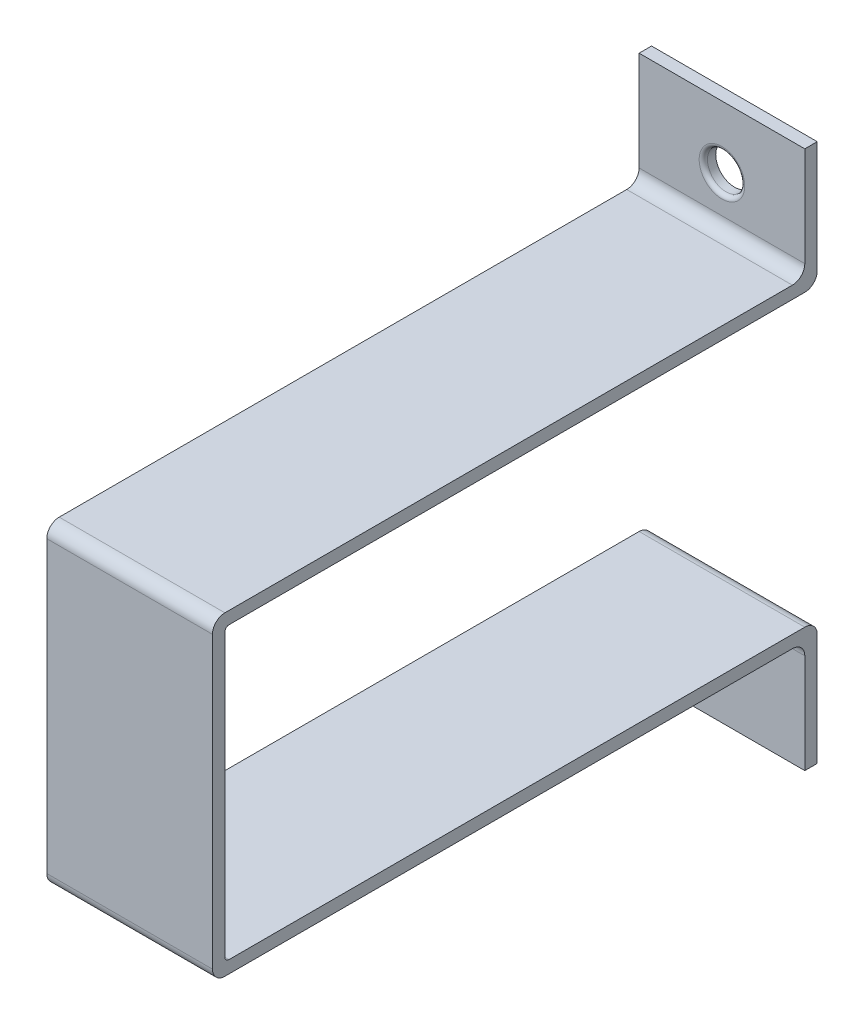
ISO-10303-21;
HEADER;
FILE_DESCRIPTION(('STEP AP214'),'2;1');
FILE_NAME('part.step','',(''),(''),'','','');
FILE_SCHEMA(('AUTOMOTIVE_DESIGN { 1 0 10303 214 1 1 1 1 }'));
ENDSEC;
DATA;
#1=APPLICATION_CONTEXT('core data for automotive mechanical design processes');
#2=APPLICATION_PROTOCOL_DEFINITION('international standard','automotive_design',2000,#1);
#3=PRODUCT_CONTEXT('',#1,'mechanical');
#4=PRODUCT('Part','Part','',(#3));
#5=PRODUCT_RELATED_PRODUCT_CATEGORY('part','',(#4));
#6=PRODUCT_DEFINITION_FORMATION('','',#4);
#7=PRODUCT_DEFINITION_CONTEXT('part definition',#1,'design');
#8=PRODUCT_DEFINITION('design','',#6,#7);
#9=PRODUCT_DEFINITION_SHAPE('','',#8);
#10=(LENGTH_UNIT() NAMED_UNIT(*) SI_UNIT(.MILLI.,.METRE.));
#11=(NAMED_UNIT(*) PLANE_ANGLE_UNIT() SI_UNIT($,.RADIAN.));
#12=(NAMED_UNIT(*) SI_UNIT($,.STERADIAN.) SOLID_ANGLE_UNIT());
#13=UNCERTAINTY_MEASURE_WITH_UNIT(LENGTH_MEASURE(1.E-05),#10,'distance_accuracy_value','');
#14=(GEOMETRIC_REPRESENTATION_CONTEXT(3) GLOBAL_UNCERTAINTY_ASSIGNED_CONTEXT((#13)) GLOBAL_UNIT_ASSIGNED_CONTEXT((#10,
#11,#12)) REPRESENTATION_CONTEXT('',''));
#15=CARTESIAN_POINT('',(0.,0.,0.));
#16=DIRECTION('',(0.,0.,1.));
#17=DIRECTION('',(1.,0.,0.));
#18=AXIS2_PLACEMENT_3D('',#15,#16,#17);
#19=CARTESIAN_POINT('',(-20.,35.,3.));
#20=DIRECTION('',(1.,0.,0.));
#21=DIRECTION('',(0.,0.,-1.));
#22=AXIS2_PLACEMENT_3D('',#19,#20,#21);
#23=PLANE('',#22);
#24=DIRECTION('',(0.,0.,1.));
#25=VECTOR('',#24,1.);
#26=CARTESIAN_POINT('',(-20.,-35.,-180.112342240263));
#27=LINE('',#26,#25);
#28=CARTESIAN_POINT('',(-20.,-35.,-140.));
#29=VERTEX_POINT('',#28);
#30=CARTESIAN_POINT('',(-20.,-35.,-1.00000000000006));
#31=VERTEX_POINT('',#30);
#32=EDGE_CURVE('E219',#29,#31,#27,.T.);
#33=ORIENTED_EDGE('',*,*,#32,.F.);
#34=CARTESIAN_POINT('',(-20.,-38.,-140.));
#35=DIRECTION('',(1.,0.,0.));
#36=DIRECTION('',(0.,0.,-1.));
#37=AXIS2_PLACEMENT_3D('',#34,#35,#36);
#38=CIRCLE('',#37,3.);
#39=CARTESIAN_POINT('',(-20.,-38.,-143.));
#40=VERTEX_POINT('',#39);
#41=EDGE_CURVE('E314',#29,#40,#38,.F.);
#42=ORIENTED_EDGE('',*,*,#41,.T.);
#43=DIRECTION('',(0.,1.,0.));
#44=VECTOR('',#43,1.);
#45=CARTESIAN_POINT('',(-20.,-35.,-143.));
#46=LINE('',#45,#44);
#47=CARTESIAN_POINT('',(-20.,-65.,-143.));
#48=VERTEX_POINT('',#47);
#49=EDGE_CURVE('E188',#48,#40,#46,.T.);
#50=ORIENTED_EDGE('',*,*,#49,.F.);
#51=DIRECTION('',(0.,0.,1.));
#52=VECTOR('',#51,1.);
#53=CARTESIAN_POINT('',(-20.,-65.,-143.));
#54=LINE('',#53,#52);
#55=CARTESIAN_POINT('',(-20.,-65.,-140.));
#56=VERTEX_POINT('',#55);
#57=EDGE_CURVE('E186',#48,#56,#54,.T.);
#58=ORIENTED_EDGE('',*,*,#57,.T.);
#59=DIRECTION('',(0.,1.,0.));
#60=VECTOR('',#59,1.);
#61=CARTESIAN_POINT('',(-20.,-35.,-140.));
#62=LINE('',#61,#60);
#63=CARTESIAN_POINT('',(-20.,-41.,-140.));
#64=VERTEX_POINT('',#63);
#65=EDGE_CURVE('E179',#56,#64,#62,.T.);
#66=ORIENTED_EDGE('',*,*,#65,.T.);
#67=CARTESIAN_POINT('',(-20.,-41.,-137.));
#68=DIRECTION('',(1.,0.,0.));
#69=DIRECTION('',(0.,0.,-1.));
#70=AXIS2_PLACEMENT_3D('',#67,#68,#69);
#71=CIRCLE('',#70,3.);
#72=CARTESIAN_POINT('',(-20.,-38.,-137.));
#73=VERTEX_POINT('',#72);
#74=EDGE_CURVE('E298',#64,#73,#71,.T.);
#75=ORIENTED_EDGE('',*,*,#74,.T.);
#76=DIRECTION('',(0.,0.,1.));
#77=VECTOR('',#76,1.);
#78=CARTESIAN_POINT('',(-20.,-38.,-180.112342240263));
#79=LINE('',#78,#77);
#80=CARTESIAN_POINT('',(-20.,-38.,0.));
#81=VERTEX_POINT('',#80);
#82=EDGE_CURVE('E218',#73,#81,#79,.T.);
#83=ORIENTED_EDGE('',*,*,#82,.T.);
#84=CARTESIAN_POINT('',(-20.,-35.,0.));
#85=DIRECTION('',(1.,0.,0.));
#86=DIRECTION('',(0.,0.,-1.));
#87=AXIS2_PLACEMENT_3D('',#84,#85,#86);
#88=CIRCLE('',#87,3.);
#89=CARTESIAN_POINT('',(-20.,-35.,3.));
#90=VERTEX_POINT('',#89);
#91=EDGE_CURVE('E272',#81,#90,#88,.F.);
#92=ORIENTED_EDGE('',*,*,#91,.T.);
#93=DIRECTION('',(0.,-1.,0.));
#94=VECTOR('',#93,1.);
#95=CARTESIAN_POINT('',(-20.,35.,3.));
#96=LINE('',#95,#94);
#97=CARTESIAN_POINT('',(-20.,35.,3.));
#98=VERTEX_POINT('',#97);
#99=EDGE_CURVE('E235',#98,#90,#96,.T.);
#100=ORIENTED_EDGE('',*,*,#99,.F.);
#101=CARTESIAN_POINT('',(-20.,35.,0.));
#102=DIRECTION('',(1.,0.,0.));
#103=DIRECTION('',(0.,0.,-1.));
#104=AXIS2_PLACEMENT_3D('',#101,#102,#103);
#105=CIRCLE('',#104,3.);
#106=CARTESIAN_POINT('',(-20.,38.,0.));
#107=VERTEX_POINT('',#106);
#108=EDGE_CURVE('E274',#98,#107,#105,.F.);
#109=ORIENTED_EDGE('',*,*,#108,.T.);
#110=DIRECTION('',(0.,0.,1.));
#111=VECTOR('',#110,1.);
#112=CARTESIAN_POINT('',(-20.,38.,-180.112342240263));
#113=LINE('',#112,#111);
#114=CARTESIAN_POINT('',(-20.,38.,-137.));
#115=VERTEX_POINT('',#114);
#116=EDGE_CURVE('E227',#115,#107,#113,.T.);
#117=ORIENTED_EDGE('',*,*,#116,.F.);
#118=CARTESIAN_POINT('',(-20.,41.,-137.));
#119=DIRECTION('',(1.,0.,0.));
#120=DIRECTION('',(0.,0.,-1.));
#121=AXIS2_PLACEMENT_3D('',#118,#119,#120);
#122=CIRCLE('',#121,3.);
#123=CARTESIAN_POINT('',(-20.,41.,-140.));
#124=VERTEX_POINT('',#123);
#125=EDGE_CURVE('E304',#115,#124,#122,.T.);
#126=ORIENTED_EDGE('',*,*,#125,.T.);
#127=DIRECTION('',(0.,1.,0.));
#128=VECTOR('',#127,1.);
#129=CARTESIAN_POINT('',(-20.,35.,-140.));
#130=LINE('',#129,#128);
#131=CARTESIAN_POINT('',(-20.,65.,-140.));
#132=VERTEX_POINT('',#131);
#133=EDGE_CURVE('E197',#124,#132,#130,.T.);
#134=ORIENTED_EDGE('',*,*,#133,.T.);
#135=DIRECTION('',(0.,0.,1.));
#136=VECTOR('',#135,1.);
#137=CARTESIAN_POINT('',(-20.,65.,-143.));
#138=LINE('',#137,#136);
#139=CARTESIAN_POINT('',(-20.,65.,-143.));
#140=VERTEX_POINT('',#139);
#141=EDGE_CURVE('E215',#140,#132,#138,.T.);
#142=ORIENTED_EDGE('',*,*,#141,.F.);
#143=DIRECTION('',(0.,1.,0.));
#144=VECTOR('',#143,1.);
#145=CARTESIAN_POINT('',(-20.,35.,-143.));
#146=LINE('',#145,#144);
#147=CARTESIAN_POINT('',(-20.,38.,-143.));
#148=VERTEX_POINT('',#147);
#149=EDGE_CURVE('E205',#148,#140,#146,.T.);
#150=ORIENTED_EDGE('',*,*,#149,.F.);
#151=CARTESIAN_POINT('',(-20.,38.,-140.));
#152=DIRECTION('',(1.,0.,0.));
#153=DIRECTION('',(0.,0.,-1.));
#154=AXIS2_PLACEMENT_3D('',#151,#152,#153);
#155=CIRCLE('',#154,3.);
#156=CARTESIAN_POINT('',(-20.,35.,-140.));
#157=VERTEX_POINT('',#156);
#158=EDGE_CURVE('E47',#148,#157,#155,.F.);
#159=ORIENTED_EDGE('',*,*,#158,.T.);
#160=DIRECTION('',(0.,0.,1.));
#161=VECTOR('',#160,1.);
#162=CARTESIAN_POINT('',(-20.,35.,-180.112342240263));
#163=LINE('',#162,#161);
#164=CARTESIAN_POINT('',(-20.,35.,-1.00000000000006));
#165=VERTEX_POINT('',#164);
#166=EDGE_CURVE('E221',#157,#165,#163,.T.);
#167=ORIENTED_EDGE('',*,*,#166,.T.);
#168=CARTESIAN_POINT('',(-20.,34.,-1.));
#169=DIRECTION('',(1.,0.,0.));
#170=DIRECTION('',(0.,0.,-1.));
#171=AXIS2_PLACEMENT_3D('',#168,#169,#170);
#172=CIRCLE('',#171,1.);
#173=CARTESIAN_POINT('',(-20.,34.,0.));
#174=VERTEX_POINT('',#173);
#175=EDGE_CURVE('E261',#165,#174,#172,.T.);
#176=ORIENTED_EDGE('',*,*,#175,.T.);
#177=DIRECTION('',(0.,-1.,0.));
#178=VECTOR('',#177,1.);
#179=CARTESIAN_POINT('',(-20.,35.,0.));
#180=LINE('',#179,#178);
#181=CARTESIAN_POINT('',(-20.,-34.,0.));
#182=VERTEX_POINT('',#181);
#183=EDGE_CURVE('E229',#174,#182,#180,.T.);
#184=ORIENTED_EDGE('',*,*,#183,.T.);
#185=CARTESIAN_POINT('',(-20.,-34.,-1.));
#186=DIRECTION('',(1.,0.,0.));
#187=DIRECTION('',(0.,0.,-1.));
#188=AXIS2_PLACEMENT_3D('',#185,#186,#187);
#189=CIRCLE('',#188,1.);
#190=EDGE_CURVE('E258',#182,#31,#189,.T.);
#191=ORIENTED_EDGE('',*,*,#190,.T.);
#192=EDGE_LOOP('',(#33,#42,#50,#58,#66,#75,#83,#92,#100,#109,#117,#126,#134,#142,#150,#159,#167,
#176,#184,#191));
#193=FACE_BOUND('',#192,.T.);
#194=ADVANCED_FACE('F32',(#193),#23,.F.);
#195=CARTESIAN_POINT('',(20.,35.,3.));
#196=DIRECTION('',(-1.,0.,0.));
#197=DIRECTION('',(0.,0.,1.));
#198=AXIS2_PLACEMENT_3D('',#195,#196,#197);
#199=PLANE('',#198);
#200=DIRECTION('',(0.,-1.,0.));
#201=VECTOR('',#200,1.);
#202=CARTESIAN_POINT('',(20.,-35.,-143.));
#203=LINE('',#202,#201);
#204=CARTESIAN_POINT('',(20.,-38.,-143.));
#205=VERTEX_POINT('',#204);
#206=CARTESIAN_POINT('',(20.,-65.,-143.));
#207=VERTEX_POINT('',#206);
#208=EDGE_CURVE('E169',#205,#207,#203,.T.);
#209=ORIENTED_EDGE('',*,*,#208,.F.);
#210=CARTESIAN_POINT('',(20.,-38.,-140.));
#211=DIRECTION('',(-1.,0.,0.));
#212=DIRECTION('',(0.,0.,1.));
#213=AXIS2_PLACEMENT_3D('',#210,#211,#212);
#214=CIRCLE('',#213,3.);
#215=CARTESIAN_POINT('',(20.,-35.,-140.));
#216=VERTEX_POINT('',#215);
#217=EDGE_CURVE('E309',#205,#216,#214,.F.);
#218=ORIENTED_EDGE('',*,*,#217,.T.);
#219=DIRECTION('',(0.,0.,1.));
#220=VECTOR('',#219,1.);
#221=CARTESIAN_POINT('',(20.,-35.,-180.112342240263));
#222=LINE('',#221,#220);
#223=CARTESIAN_POINT('',(20.,-35.,-1.00000000000006));
#224=VERTEX_POINT('',#223);
#225=EDGE_CURVE('E222',#216,#224,#222,.T.);
#226=ORIENTED_EDGE('',*,*,#225,.T.);
#227=CARTESIAN_POINT('',(20.,-34.,-1.));
#228=DIRECTION('',(-1.,0.,0.));
#229=DIRECTION('',(0.,0.,1.));
#230=AXIS2_PLACEMENT_3D('',#227,#228,#229);
#231=CIRCLE('',#230,1.);
#232=CARTESIAN_POINT('',(20.,-34.,0.));
#233=VERTEX_POINT('',#232);
#234=EDGE_CURVE('E256',#224,#233,#231,.T.);
#235=ORIENTED_EDGE('',*,*,#234,.T.);
#236=DIRECTION('',(0.,1.,0.));
#237=VECTOR('',#236,1.);
#238=CARTESIAN_POINT('',(20.,35.,0.));
#239=LINE('',#238,#237);
#240=CARTESIAN_POINT('',(20.,34.,0.));
#241=VERTEX_POINT('',#240);
#242=EDGE_CURVE('E239',#233,#241,#239,.T.);
#243=ORIENTED_EDGE('',*,*,#242,.T.);
#244=CARTESIAN_POINT('',(20.,34.,-1.));
#245=DIRECTION('',(-1.,0.,0.));
#246=DIRECTION('',(0.,0.,1.));
#247=AXIS2_PLACEMENT_3D('',#244,#245,#246);
#248=CIRCLE('',#247,1.);
#249=CARTESIAN_POINT('',(20.,35.,-1.00000000000006));
#250=VERTEX_POINT('',#249);
#251=EDGE_CURVE('E263',#241,#250,#248,.T.);
#252=ORIENTED_EDGE('',*,*,#251,.T.);
#253=DIRECTION('',(0.,0.,1.));
#254=VECTOR('',#253,1.);
#255=CARTESIAN_POINT('',(20.,35.,-180.112342240263));
#256=LINE('',#255,#254);
#257=CARTESIAN_POINT('',(20.,35.,-140.));
#258=VERTEX_POINT('',#257);
#259=EDGE_CURVE('E232',#258,#250,#256,.T.);
#260=ORIENTED_EDGE('',*,*,#259,.F.);
#261=CARTESIAN_POINT('',(20.,38.,-140.));
#262=DIRECTION('',(-1.,0.,0.));
#263=DIRECTION('',(0.,0.,1.));
#264=AXIS2_PLACEMENT_3D('',#261,#262,#263);
#265=CIRCLE('',#264,3.);
#266=CARTESIAN_POINT('',(20.,38.,-143.));
#267=VERTEX_POINT('',#266);
#268=EDGE_CURVE('E307',#258,#267,#265,.F.);
#269=ORIENTED_EDGE('',*,*,#268,.T.);
#270=DIRECTION('',(0.,-1.,0.));
#271=VECTOR('',#270,1.);
#272=CARTESIAN_POINT('',(20.,35.,-143.));
#273=LINE('',#272,#271);
#274=CARTESIAN_POINT('',(20.,65.,-143.));
#275=VERTEX_POINT('',#274);
#276=EDGE_CURVE('E202',#275,#267,#273,.T.);
#277=ORIENTED_EDGE('',*,*,#276,.F.);
#278=DIRECTION('',(0.,0.,1.));
#279=VECTOR('',#278,1.);
#280=CARTESIAN_POINT('',(20.,65.,-143.));
#281=LINE('',#280,#279);
#282=CARTESIAN_POINT('',(20.,65.,-140.));
#283=VERTEX_POINT('',#282);
#284=EDGE_CURVE('E209',#275,#283,#281,.T.);
#285=ORIENTED_EDGE('',*,*,#284,.T.);
#286=DIRECTION('',(0.,-1.,0.));
#287=VECTOR('',#286,1.);
#288=CARTESIAN_POINT('',(20.,35.,-140.));
#289=LINE('',#288,#287);
#290=CARTESIAN_POINT('',(20.,41.,-140.));
#291=VERTEX_POINT('',#290);
#292=EDGE_CURVE('E194',#283,#291,#289,.T.);
#293=ORIENTED_EDGE('',*,*,#292,.T.);
#294=CARTESIAN_POINT('',(20.,41.,-137.));
#295=DIRECTION('',(-1.,0.,0.));
#296=DIRECTION('',(0.,0.,1.));
#297=AXIS2_PLACEMENT_3D('',#294,#295,#296);
#298=CIRCLE('',#297,3.);
#299=CARTESIAN_POINT('',(20.,38.,-137.));
#300=VERTEX_POINT('',#299);
#301=EDGE_CURVE('E302',#291,#300,#298,.T.);
#302=ORIENTED_EDGE('',*,*,#301,.T.);
#303=DIRECTION('',(0.,0.,1.));
#304=VECTOR('',#303,1.);
#305=CARTESIAN_POINT('',(20.,38.,-180.112342240263));
#306=LINE('',#305,#304);
#307=CARTESIAN_POINT('',(20.,38.,0.));
#308=VERTEX_POINT('',#307);
#309=EDGE_CURVE('E230',#300,#308,#306,.T.);
#310=ORIENTED_EDGE('',*,*,#309,.T.);
#311=CARTESIAN_POINT('',(20.,35.,0.));
#312=DIRECTION('',(-1.,0.,0.));
#313=DIRECTION('',(0.,0.,1.));
#314=AXIS2_PLACEMENT_3D('',#311,#312,#313);
#315=CIRCLE('',#314,3.);
#316=CARTESIAN_POINT('',(20.,35.,3.));
#317=VERTEX_POINT('',#316);
#318=EDGE_CURVE('E283',#308,#317,#315,.F.);
#319=ORIENTED_EDGE('',*,*,#318,.T.);
#320=DIRECTION('',(0.,1.,0.));
#321=VECTOR('',#320,1.);
#322=CARTESIAN_POINT('',(20.,35.,3.));
#323=LINE('',#322,#321);
#324=CARTESIAN_POINT('',(20.,-35.,3.));
#325=VERTEX_POINT('',#324);
#326=EDGE_CURVE('E238',#325,#317,#323,.T.);
#327=ORIENTED_EDGE('',*,*,#326,.F.);
#328=CARTESIAN_POINT('',(20.,-35.,0.));
#329=DIRECTION('',(-1.,0.,0.));
#330=DIRECTION('',(0.,0.,1.));
#331=AXIS2_PLACEMENT_3D('',#328,#329,#330);
#332=CIRCLE('',#331,3.);
#333=CARTESIAN_POINT('',(20.,-38.,0.));
#334=VERTEX_POINT('',#333);
#335=EDGE_CURVE('E280',#325,#334,#332,.F.);
#336=ORIENTED_EDGE('',*,*,#335,.T.);
#337=DIRECTION('',(0.,0.,1.));
#338=VECTOR('',#337,1.);
#339=CARTESIAN_POINT('',(20.,-38.,-180.112342240263));
#340=LINE('',#339,#338);
#341=CARTESIAN_POINT('',(20.,-38.,-137.));
#342=VERTEX_POINT('',#341);
#343=EDGE_CURVE('E224',#342,#334,#340,.T.);
#344=ORIENTED_EDGE('',*,*,#343,.F.);
#345=CARTESIAN_POINT('',(20.,-41.,-137.));
#346=DIRECTION('',(-1.,0.,0.));
#347=DIRECTION('',(0.,0.,1.));
#348=AXIS2_PLACEMENT_3D('',#345,#346,#347);
#349=CIRCLE('',#348,3.);
#350=CARTESIAN_POINT('',(20.,-41.,-140.));
#351=VERTEX_POINT('',#350);
#352=EDGE_CURVE('E300',#342,#351,#349,.T.);
#353=ORIENTED_EDGE('',*,*,#352,.T.);
#354=DIRECTION('',(0.,-1.,0.));
#355=VECTOR('',#354,1.);
#356=CARTESIAN_POINT('',(20.,-35.,-140.));
#357=LINE('',#356,#355);
#358=CARTESIAN_POINT('',(20.,-65.,-140.));
#359=VERTEX_POINT('',#358);
#360=EDGE_CURVE('E192',#351,#359,#357,.T.);
#361=ORIENTED_EDGE('',*,*,#360,.T.);
#362=DIRECTION('',(0.,0.,1.));
#363=VECTOR('',#362,1.);
#364=CARTESIAN_POINT('',(20.,-65.,-143.));
#365=LINE('',#364,#363);
#366=EDGE_CURVE('E184',#207,#359,#365,.T.);
#367=ORIENTED_EDGE('',*,*,#366,.F.);
#368=EDGE_LOOP('',(#209,#218,#226,#235,#243,#252,#260,#269,#277,#285,#293,#302,#310,#319,#327,
#336,#344,#353,#361,#367));
#369=FACE_BOUND('',#368,.T.);
#370=ADVANCED_FACE('F190',(#369),#199,.F.);
#371=CARTESIAN_POINT('',(0.,0.,3.));
#372=DIRECTION('',(0.,0.,1.));
#373=DIRECTION('',(1.,0.,0.));
#374=AXIS2_PLACEMENT_3D('',#371,#372,#373);
#375=PLANE('',#374);
#376=ORIENTED_EDGE('',*,*,#326,.T.);
#377=DIRECTION('',(-1.,0.,0.));
#378=VECTOR('',#377,1.);
#379=CARTESIAN_POINT('',(0.,35.,3.));
#380=LINE('',#379,#378);
#381=EDGE_CURVE('E269',#317,#98,#380,.T.);
#382=ORIENTED_EDGE('',*,*,#381,.T.);
#383=ORIENTED_EDGE('',*,*,#99,.T.);
#384=DIRECTION('',(1.,0.,0.));
#385=VECTOR('',#384,1.);
#386=CARTESIAN_POINT('',(0.,-35.,3.));
#387=LINE('',#386,#385);
#388=EDGE_CURVE('E266',#90,#325,#387,.T.);
#389=ORIENTED_EDGE('',*,*,#388,.T.);
#390=EDGE_LOOP('',(#376,#382,#383,#389));
#391=FACE_BOUND('',#390,.T.);
#392=ADVANCED_FACE('F345',(#391),#375,.T.);
#393=CARTESIAN_POINT('',(0.,0.,0.));
#394=DIRECTION('',(0.,0.,1.));
#395=DIRECTION('',(1.,0.,0.));
#396=AXIS2_PLACEMENT_3D('',#393,#394,#395);
#397=PLANE('',#396);
#398=ORIENTED_EDGE('',*,*,#242,.F.);
#399=DIRECTION('',(1.,0.,0.));
#400=VECTOR('',#399,1.);
#401=CARTESIAN_POINT('',(0.,-34.,0.));
#402=LINE('',#401,#400);
#403=EDGE_CURVE('E251',#233,#182,#402,.F.);
#404=ORIENTED_EDGE('',*,*,#403,.T.);
#405=ORIENTED_EDGE('',*,*,#183,.F.);
#406=DIRECTION('',(-1.,0.,0.));
#407=VECTOR('',#406,1.);
#408=CARTESIAN_POINT('',(0.,34.,0.));
#409=LINE('',#408,#407);
#410=EDGE_CURVE('E249',#174,#241,#409,.F.);
#411=ORIENTED_EDGE('',*,*,#410,.T.);
#412=EDGE_LOOP('',(#398,#404,#405,#411));
#413=FACE_BOUND('',#412,.T.);
#414=ADVANCED_FACE('F466',(#413),#397,.F.);
#415=CARTESIAN_POINT('',(-20.,38.,-180.112342240263));
#416=DIRECTION('',(0.,1.,0.));
#417=DIRECTION('',(0.,0.,1.));
#418=AXIS2_PLACEMENT_3D('',#415,#416,#417);
#419=PLANE('',#418);
#420=ORIENTED_EDGE('',*,*,#309,.F.);
#421=DIRECTION('',(1.,0.,0.));
#422=VECTOR('',#421,1.);
#423=CARTESIAN_POINT('',(-20.,38.,-137.));
#424=LINE('',#423,#422);
#425=EDGE_CURVE('E296',#300,#115,#424,.F.);
#426=ORIENTED_EDGE('',*,*,#425,.T.);
#427=ORIENTED_EDGE('',*,*,#116,.T.);
#428=DIRECTION('',(-1.,0.,0.));
#429=VECTOR('',#428,1.);
#430=CARTESIAN_POINT('',(-20.,38.,0.));
#431=LINE('',#430,#429);
#432=EDGE_CURVE('E277',#107,#308,#431,.F.);
#433=ORIENTED_EDGE('',*,*,#432,.T.);
#434=EDGE_LOOP('',(#420,#426,#427,#433));
#435=FACE_BOUND('',#434,.T.);
#436=ADVANCED_FACE('F402',(#435),#419,.T.);
#437=CARTESIAN_POINT('',(-20.,35.,-180.112342240263));
#438=DIRECTION('',(0.,-1.,0.));
#439=DIRECTION('',(0.,0.,-1.));
#440=AXIS2_PLACEMENT_3D('',#437,#438,#439);
#441=PLANE('',#440);
#442=ORIENTED_EDGE('',*,*,#166,.F.);
#443=DIRECTION('',(-1.,0.,0.));
#444=VECTOR('',#443,1.);
#445=CARTESIAN_POINT('',(20.,35.,-140.));
#446=LINE('',#445,#444);
#447=EDGE_CURVE('E318',#157,#258,#446,.F.);
#448=ORIENTED_EDGE('',*,*,#447,.T.);
#449=ORIENTED_EDGE('',*,*,#259,.T.);
#450=DIRECTION('',(-1.,0.,0.));
#451=VECTOR('',#450,1.);
#452=CARTESIAN_POINT('',(-20.,35.,-1.));
#453=LINE('',#452,#451);
#454=EDGE_CURVE('E253',#250,#165,#453,.T.);
#455=ORIENTED_EDGE('',*,*,#454,.T.);
#456=EDGE_LOOP('',(#442,#448,#449,#455));
#457=FACE_BOUND('',#456,.T.);
#458=ADVANCED_FACE('F460',(#457),#441,.T.);
#459=CARTESIAN_POINT('',(-20.,-35.,-180.112342240263));
#460=DIRECTION('',(0.,1.,0.));
#461=DIRECTION('',(0.,0.,1.));
#462=AXIS2_PLACEMENT_3D('',#459,#460,#461);
#463=PLANE('',#462);
#464=ORIENTED_EDGE('',*,*,#225,.F.);
#465=DIRECTION('',(1.,0.,0.));
#466=VECTOR('',#465,1.);
#467=CARTESIAN_POINT('',(-20.,-35.,-140.));
#468=LINE('',#467,#466);
#469=EDGE_CURVE('E311',#216,#29,#468,.F.);
#470=ORIENTED_EDGE('',*,*,#469,.T.);
#471=ORIENTED_EDGE('',*,*,#32,.T.);
#472=DIRECTION('',(1.,0.,0.));
#473=VECTOR('',#472,1.);
#474=CARTESIAN_POINT('',(-20.,-35.,-1.));
#475=LINE('',#474,#473);
#476=EDGE_CURVE('E242',#31,#224,#475,.T.);
#477=ORIENTED_EDGE('',*,*,#476,.T.);
#478=EDGE_LOOP('',(#464,#470,#471,#477));
#479=FACE_BOUND('',#478,.T.);
#480=ADVANCED_FACE('F457',(#479),#463,.T.);
#481=CARTESIAN_POINT('',(-20.,-38.,-180.112342240263));
#482=DIRECTION('',(0.,-1.,0.));
#483=DIRECTION('',(0.,0.,-1.));
#484=AXIS2_PLACEMENT_3D('',#481,#482,#483);
#485=PLANE('',#484);
#486=ORIENTED_EDGE('',*,*,#82,.F.);
#487=DIRECTION('',(-1.,0.,0.));
#488=VECTOR('',#487,1.);
#489=CARTESIAN_POINT('',(-20.,-38.,-137.));
#490=LINE('',#489,#488);
#491=EDGE_CURVE('E291',#73,#342,#490,.F.);
#492=ORIENTED_EDGE('',*,*,#491,.T.);
#493=ORIENTED_EDGE('',*,*,#343,.T.);
#494=DIRECTION('',(1.,0.,0.));
#495=VECTOR('',#494,1.);
#496=CARTESIAN_POINT('',(-20.,-38.,0.));
#497=LINE('',#496,#495);
#498=EDGE_CURVE('E285',#334,#81,#497,.F.);
#499=ORIENTED_EDGE('',*,*,#498,.T.);
#500=EDGE_LOOP('',(#486,#492,#493,#499));
#501=FACE_BOUND('',#500,.T.);
#502=ADVANCED_FACE('F456',(#501),#485,.T.);
#503=CARTESIAN_POINT('',(20.,65.,-143.));
#504=DIRECTION('',(0.,-1.,0.));
#505=DIRECTION('',(0.,0.,-1.));
#506=AXIS2_PLACEMENT_3D('',#503,#504,#505);
#507=PLANE('',#506);
#508=DIRECTION('',(1.,0.,0.));
#509=VECTOR('',#508,1.);
#510=CARTESIAN_POINT('',(20.,65.,-140.));
#511=LINE('',#510,#509);
#512=EDGE_CURVE('E206',#132,#283,#511,.T.);
#513=ORIENTED_EDGE('',*,*,#512,.T.);
#514=ORIENTED_EDGE('',*,*,#284,.F.);
#515=DIRECTION('',(1.,0.,0.));
#516=VECTOR('',#515,1.);
#517=CARTESIAN_POINT('',(20.,65.,-143.));
#518=LINE('',#517,#516);
#519=EDGE_CURVE('E208',#140,#275,#518,.T.);
#520=ORIENTED_EDGE('',*,*,#519,.F.);
#521=ORIENTED_EDGE('',*,*,#141,.T.);
#522=EDGE_LOOP('',(#513,#514,#520,#521));
#523=FACE_BOUND('',#522,.T.);
#524=ADVANCED_FACE('F391',(#523),#507,.F.);
#525=CARTESIAN_POINT('',(0.,0.,-143.));
#526=DIRECTION('',(0.,0.,1.));
#527=DIRECTION('',(1.,0.,0.));
#528=AXIS2_PLACEMENT_3D('',#525,#526,#527);
#529=PLANE('',#528);
#530=CARTESIAN_POINT('',(0.,50.,-143.));
#531=DIRECTION('',(0.,0.,-1.));
#532=DIRECTION('',(-1.,0.,0.));
#533=AXIS2_PLACEMENT_3D('',#530,#531,#532);
#534=CIRCLE('',#533,4.5);
#535=CARTESIAN_POINT('',(-4.5,50.,-143.));
#536=VERTEX_POINT('',#535);
#537=EDGE_CURVE('E427',#536,#536,#534,.T.);
#538=ORIENTED_EDGE('',*,*,#537,.F.);
#539=EDGE_LOOP('',(#538));
#540=FACE_BOUND('',#539,.T.);
#541=ORIENTED_EDGE('',*,*,#276,.T.);
#542=DIRECTION('',(-1.,0.,0.));
#543=VECTOR('',#542,1.);
#544=CARTESIAN_POINT('',(-20.,38.,-143.));
#545=LINE('',#544,#543);
#546=EDGE_CURVE('E316',#267,#148,#545,.T.);
#547=ORIENTED_EDGE('',*,*,#546,.T.);
#548=ORIENTED_EDGE('',*,*,#149,.T.);
#549=ORIENTED_EDGE('',*,*,#519,.T.);
#550=EDGE_LOOP('',(#541,#547,#548,#549));
#551=FACE_BOUND('',#550,.T.);
#552=ADVANCED_FACE('F386',(#540,#551),#529,.F.);
#553=CARTESIAN_POINT('',(0.,0.,-140.));
#554=DIRECTION('',(0.,0.,1.));
#555=DIRECTION('',(1.,0.,0.));
#556=AXIS2_PLACEMENT_3D('',#553,#554,#555);
#557=PLANE('',#556);
#558=CARTESIAN_POINT('',(0.,50.,-140.));
#559=DIRECTION('',(0.,0.,1.));
#560=DIRECTION('',(1.,0.,0.));
#561=AXIS2_PLACEMENT_3D('',#558,#559,#560);
#562=CIRCLE('',#561,5.5);
#563=CARTESIAN_POINT('',(5.5,50.,-140.));
#564=VERTEX_POINT('',#563);
#565=EDGE_CURVE('E11',#564,#564,#562,.F.);
#566=ORIENTED_EDGE('',*,*,#565,.T.);
#567=EDGE_LOOP('',(#566));
#568=FACE_BOUND('',#567,.T.);
#569=ORIENTED_EDGE('',*,*,#133,.F.);
#570=DIRECTION('',(1.,0.,0.));
#571=VECTOR('',#570,1.);
#572=CARTESIAN_POINT('',(20.,41.,-140.));
#573=LINE('',#572,#571);
#574=EDGE_CURVE('E293',#124,#291,#573,.T.);
#575=ORIENTED_EDGE('',*,*,#574,.T.);
#576=ORIENTED_EDGE('',*,*,#292,.F.);
#577=ORIENTED_EDGE('',*,*,#512,.F.);
#578=EDGE_LOOP('',(#569,#575,#576,#577));
#579=FACE_BOUND('',#578,.T.);
#580=ADVANCED_FACE('F396',(#568,#579),#557,.T.);
#581=CARTESIAN_POINT('',(20.,-65.,-143.));
#582=DIRECTION('',(0.,1.,0.));
#583=DIRECTION('',(0.,0.,1.));
#584=AXIS2_PLACEMENT_3D('',#581,#582,#583);
#585=PLANE('',#584);
#586=DIRECTION('',(-1.,0.,0.));
#587=VECTOR('',#586,1.);
#588=CARTESIAN_POINT('',(20.,-65.,-140.));
#589=LINE('',#588,#587);
#590=EDGE_CURVE('E423',#359,#56,#589,.T.);
#591=ORIENTED_EDGE('',*,*,#590,.T.);
#592=ORIENTED_EDGE('',*,*,#57,.F.);
#593=DIRECTION('',(-1.,0.,0.));
#594=VECTOR('',#593,1.);
#595=CARTESIAN_POINT('',(20.,-65.,-143.));
#596=LINE('',#595,#594);
#597=EDGE_CURVE('E173',#207,#48,#596,.T.);
#598=ORIENTED_EDGE('',*,*,#597,.F.);
#599=ORIENTED_EDGE('',*,*,#366,.T.);
#600=EDGE_LOOP('',(#591,#592,#598,#599));
#601=FACE_BOUND('',#600,.T.);
#602=ADVANCED_FACE('F183',(#601),#585,.F.);
#603=CARTESIAN_POINT('',(0.,0.,-143.));
#604=DIRECTION('',(0.,0.,-1.));
#605=DIRECTION('',(-1.,0.,0.));
#606=AXIS2_PLACEMENT_3D('',#603,#604,#605);
#607=PLANE('',#606);
#608=CARTESIAN_POINT('',(0.,-50.,-143.));
#609=DIRECTION('',(0.,0.,-1.));
#610=DIRECTION('',(1.,0.,0.));
#611=AXIS2_PLACEMENT_3D('',#608,#609,#610);
#612=CIRCLE('',#611,4.5);
#613=CARTESIAN_POINT('',(4.49999999999998,-50.,-143.));
#614=VERTEX_POINT('',#613);
#615=EDGE_CURVE('E431',#614,#614,#612,.T.);
#616=ORIENTED_EDGE('',*,*,#615,.F.);
#617=EDGE_LOOP('',(#616));
#618=FACE_BOUND('',#617,.T.);
#619=ORIENTED_EDGE('',*,*,#49,.T.);
#620=DIRECTION('',(1.,0.,0.));
#621=VECTOR('',#620,1.);
#622=CARTESIAN_POINT('',(0.,-38.,-143.));
#623=LINE('',#622,#621);
#624=EDGE_CURVE('E176',#40,#205,#623,.T.);
#625=ORIENTED_EDGE('',*,*,#624,.T.);
#626=ORIENTED_EDGE('',*,*,#208,.T.);
#627=ORIENTED_EDGE('',*,*,#597,.T.);
#628=EDGE_LOOP('',(#619,#625,#626,#627));
#629=FACE_BOUND('',#628,.T.);
#630=ADVANCED_FACE('F172',(#618,#629),#607,.T.);
#631=CARTESIAN_POINT('',(0.,0.,-140.));
#632=DIRECTION('',(0.,0.,-1.));
#633=DIRECTION('',(-1.,0.,0.));
#634=AXIS2_PLACEMENT_3D('',#631,#632,#633);
#635=PLANE('',#634);
#636=CARTESIAN_POINT('',(0.,-50.,-140.));
#637=DIRECTION('',(0.,0.,-1.));
#638=DIRECTION('',(-1.,0.,0.));
#639=AXIS2_PLACEMENT_3D('',#636,#637,#638);
#640=CIRCLE('',#639,5.5);
#641=CARTESIAN_POINT('',(-5.50000000000003,-50.,-140.));
#642=VERTEX_POINT('',#641);
#643=EDGE_CURVE('E320',#642,#642,#640,.T.);
#644=ORIENTED_EDGE('',*,*,#643,.T.);
#645=EDGE_LOOP('',(#644));
#646=FACE_BOUND('',#645,.T.);
#647=ORIENTED_EDGE('',*,*,#360,.F.);
#648=DIRECTION('',(-1.,0.,0.));
#649=VECTOR('',#648,1.);
#650=CARTESIAN_POINT('',(0.,-41.,-140.));
#651=LINE('',#650,#649);
#652=EDGE_CURVE('E288',#351,#64,#651,.T.);
#653=ORIENTED_EDGE('',*,*,#652,.T.);
#654=ORIENTED_EDGE('',*,*,#65,.F.);
#655=ORIENTED_EDGE('',*,*,#590,.F.);
#656=EDGE_LOOP('',(#647,#653,#654,#655));
#657=FACE_BOUND('',#656,.T.);
#658=ADVANCED_FACE('F421',(#646,#657),#635,.F.);
#659=CARTESIAN_POINT('',(0.,50.,3.));
#660=DIRECTION('',(0.,0.,-1.));
#661=DIRECTION('',(-1.,0.,0.));
#662=AXIS2_PLACEMENT_3D('',#659,#660,#661);
#663=CYLINDRICAL_SURFACE('',#662,4.5);
#664=CARTESIAN_POINT('',(0.,50.,-141.));
#665=DIRECTION('',(0.,0.,1.));
#666=DIRECTION('',(1.,0.,0.));
#667=AXIS2_PLACEMENT_3D('',#664,#665,#666);
#668=CIRCLE('',#667,4.5);
#669=CARTESIAN_POINT('',(4.5,50.,-141.));
#670=VERTEX_POINT('',#669);
#671=EDGE_CURVE('E40',#670,#670,#668,.T.);
#672=ORIENTED_EDGE('',*,*,#671,.T.);
#673=EDGE_LOOP('',(#672));
#674=FACE_BOUND('',#673,.T.);
#675=ORIENTED_EDGE('',*,*,#537,.T.);
#676=EDGE_LOOP('',(#675));
#677=FACE_BOUND('',#676,.T.);
#678=ADVANCED_FACE('F328',(#674,#677),#663,.F.);
#679=CARTESIAN_POINT('',(0.,-50.,3.));
#680=DIRECTION('',(0.,0.,-1.));
#681=DIRECTION('',(-1.,0.,0.));
#682=AXIS2_PLACEMENT_3D('',#679,#680,#681);
#683=CYLINDRICAL_SURFACE('',#682,4.5);
#684=CARTESIAN_POINT('',(0.,-50.,-141.));
#685=DIRECTION('',(0.,0.,-1.));
#686=DIRECTION('',(-1.,0.,0.));
#687=AXIS2_PLACEMENT_3D('',#684,#685,#686);
#688=CIRCLE('',#687,4.5);
#689=CARTESIAN_POINT('',(-4.50000000000003,-50.,-141.));
#690=VERTEX_POINT('',#689);
#691=EDGE_CURVE('E323',#690,#690,#688,.F.);
#692=ORIENTED_EDGE('',*,*,#691,.T.);
#693=EDGE_LOOP('',(#692));
#694=FACE_BOUND('',#693,.T.);
#695=ORIENTED_EDGE('',*,*,#615,.T.);
#696=EDGE_LOOP('',(#695));
#697=FACE_BOUND('',#696,.T.);
#698=ADVANCED_FACE('F354',(#694,#697),#683,.F.);
#699=CARTESIAN_POINT('',(-20.,-34.,-1.));
#700=DIRECTION('',(1.,0.,0.));
#701=DIRECTION('',(0.,0.,-1.));
#702=AXIS2_PLACEMENT_3D('',#699,#700,#701);
#703=CYLINDRICAL_SURFACE('',#702,1.);
#704=ORIENTED_EDGE('',*,*,#190,.F.);
#705=ORIENTED_EDGE('',*,*,#403,.F.);
#706=ORIENTED_EDGE('',*,*,#234,.F.);
#707=ORIENTED_EDGE('',*,*,#476,.F.);
#708=EDGE_LOOP('',(#704,#705,#706,#707));
#709=FACE_BOUND('',#708,.T.);
#710=ADVANCED_FACE('F350',(#709),#703,.F.);
#711=CARTESIAN_POINT('',(-20.,34.,-1.));
#712=DIRECTION('',(-1.,0.,0.));
#713=DIRECTION('',(0.,0.,1.));
#714=AXIS2_PLACEMENT_3D('',#711,#712,#713);
#715=CYLINDRICAL_SURFACE('',#714,1.);
#716=ORIENTED_EDGE('',*,*,#251,.F.);
#717=ORIENTED_EDGE('',*,*,#410,.F.);
#718=ORIENTED_EDGE('',*,*,#175,.F.);
#719=ORIENTED_EDGE('',*,*,#454,.F.);
#720=EDGE_LOOP('',(#716,#717,#718,#719));
#721=FACE_BOUND('',#720,.T.);
#722=ADVANCED_FACE('F353',(#721),#715,.F.);
#723=CARTESIAN_POINT('',(0.,35.,0.));
#724=DIRECTION('',(-1.,0.,0.));
#725=DIRECTION('',(0.,0.,1.));
#726=AXIS2_PLACEMENT_3D('',#723,#724,#725);
#727=CYLINDRICAL_SURFACE('',#726,3.);
#728=ORIENTED_EDGE('',*,*,#318,.F.);
#729=ORIENTED_EDGE('',*,*,#432,.F.);
#730=ORIENTED_EDGE('',*,*,#108,.F.);
#731=ORIENTED_EDGE('',*,*,#381,.F.);
#732=EDGE_LOOP('',(#728,#729,#730,#731));
#733=FACE_BOUND('',#732,.T.);
#734=ADVANCED_FACE('F358',(#733),#727,.T.);
#735=CARTESIAN_POINT('',(0.,-35.,0.));
#736=DIRECTION('',(1.,0.,0.));
#737=DIRECTION('',(0.,0.,-1.));
#738=AXIS2_PLACEMENT_3D('',#735,#736,#737);
#739=CYLINDRICAL_SURFACE('',#738,3.);
#740=ORIENTED_EDGE('',*,*,#91,.F.);
#741=ORIENTED_EDGE('',*,*,#498,.F.);
#742=ORIENTED_EDGE('',*,*,#335,.F.);
#743=ORIENTED_EDGE('',*,*,#388,.F.);
#744=EDGE_LOOP('',(#740,#741,#742,#743));
#745=FACE_BOUND('',#744,.T.);
#746=ADVANCED_FACE('F362',(#745),#739,.T.);
#747=CARTESIAN_POINT('',(0.,-41.,-137.));
#748=DIRECTION('',(-1.,0.,0.));
#749=DIRECTION('',(0.,0.,1.));
#750=AXIS2_PLACEMENT_3D('',#747,#748,#749);
#751=CYLINDRICAL_SURFACE('',#750,3.);
#752=ORIENTED_EDGE('',*,*,#352,.F.);
#753=ORIENTED_EDGE('',*,*,#491,.F.);
#754=ORIENTED_EDGE('',*,*,#74,.F.);
#755=ORIENTED_EDGE('',*,*,#652,.F.);
#756=EDGE_LOOP('',(#752,#753,#754,#755));
#757=FACE_BOUND('',#756,.T.);
#758=ADVANCED_FACE('F366',(#757),#751,.F.);
#759=CARTESIAN_POINT('',(0.,41.,-137.));
#760=DIRECTION('',(-1.,0.,0.));
#761=DIRECTION('',(0.,0.,1.));
#762=AXIS2_PLACEMENT_3D('',#759,#760,#761);
#763=CYLINDRICAL_SURFACE('',#762,3.);
#764=ORIENTED_EDGE('',*,*,#125,.F.);
#765=ORIENTED_EDGE('',*,*,#425,.F.);
#766=ORIENTED_EDGE('',*,*,#301,.F.);
#767=ORIENTED_EDGE('',*,*,#574,.F.);
#768=EDGE_LOOP('',(#764,#765,#766,#767));
#769=FACE_BOUND('',#768,.T.);
#770=ADVANCED_FACE('F370',(#769),#763,.F.);
#771=CARTESIAN_POINT('',(0.,-38.,-140.));
#772=DIRECTION('',(1.,0.,0.));
#773=DIRECTION('',(0.,0.,-1.));
#774=AXIS2_PLACEMENT_3D('',#771,#772,#773);
#775=CYLINDRICAL_SURFACE('',#774,3.);
#776=ORIENTED_EDGE('',*,*,#41,.F.);
#777=ORIENTED_EDGE('',*,*,#469,.F.);
#778=ORIENTED_EDGE('',*,*,#217,.F.);
#779=ORIENTED_EDGE('',*,*,#624,.F.);
#780=EDGE_LOOP('',(#776,#777,#778,#779));
#781=FACE_BOUND('',#780,.T.);
#782=ADVANCED_FACE('F374',(#781),#775,.T.);
#783=CARTESIAN_POINT('',(0.,38.,-140.));
#784=DIRECTION('',(1.,0.,0.));
#785=DIRECTION('',(0.,0.,-1.));
#786=AXIS2_PLACEMENT_3D('',#783,#784,#785);
#787=CYLINDRICAL_SURFACE('',#786,3.);
#788=ORIENTED_EDGE('',*,*,#268,.F.);
#789=ORIENTED_EDGE('',*,*,#447,.F.);
#790=ORIENTED_EDGE('',*,*,#158,.F.);
#791=ORIENTED_EDGE('',*,*,#546,.F.);
#792=EDGE_LOOP('',(#788,#789,#790,#791));
#793=FACE_BOUND('',#792,.T.);
#794=ADVANCED_FACE('F337',(#793),#787,.T.);
#795=CARTESIAN_POINT('',(0.,-50.,-141.));
#796=DIRECTION('',(0.,0.,-1.));
#797=DIRECTION('',(-1.,0.,0.));
#798=AXIS2_PLACEMENT_3D('',#795,#796,#797);
#799=TOROIDAL_SURFACE('',#798,5.5,1.);
#800=ORIENTED_EDGE('',*,*,#691,.F.);
#801=EDGE_LOOP('',(#800));
#802=FACE_BOUND('',#801,.T.);
#803=ORIENTED_EDGE('',*,*,#643,.F.);
#804=EDGE_LOOP('',(#803));
#805=FACE_BOUND('',#804,.T.);
#806=ADVANCED_FACE('F332',(#802,#805),#799,.T.);
#807=CARTESIAN_POINT('',(0.,50.,-141.));
#808=DIRECTION('',(0.,0.,1.));
#809=DIRECTION('',(1.,0.,0.));
#810=AXIS2_PLACEMENT_3D('',#807,#808,#809);
#811=TOROIDAL_SURFACE('',#810,5.5,1.);
#812=ORIENTED_EDGE('',*,*,#565,.F.);
#813=EDGE_LOOP('',(#812));
#814=FACE_BOUND('',#813,.T.);
#815=ORIENTED_EDGE('',*,*,#671,.F.);
#816=EDGE_LOOP('',(#815));
#817=FACE_BOUND('',#816,.T.);
#818=ADVANCED_FACE('F34',(#814,#817),#811,.T.);
#819=CLOSED_SHELL('',(#194,#370,#392,#414,#436,#458,#480,#502,#524,#552,#580,#602,#630,#658,
#678,#698,#710,#722,#734,#746,#758,#770,#782,#794,#806,#818));
#820=MANIFOLD_SOLID_BREP('B2',#819);
#821=ADVANCED_BREP_SHAPE_REPRESENTATION('',(#18,#820),#14);
#822=SHAPE_DEFINITION_REPRESENTATION(#9,#821);
ENDSEC;
END-ISO-10303-21;
